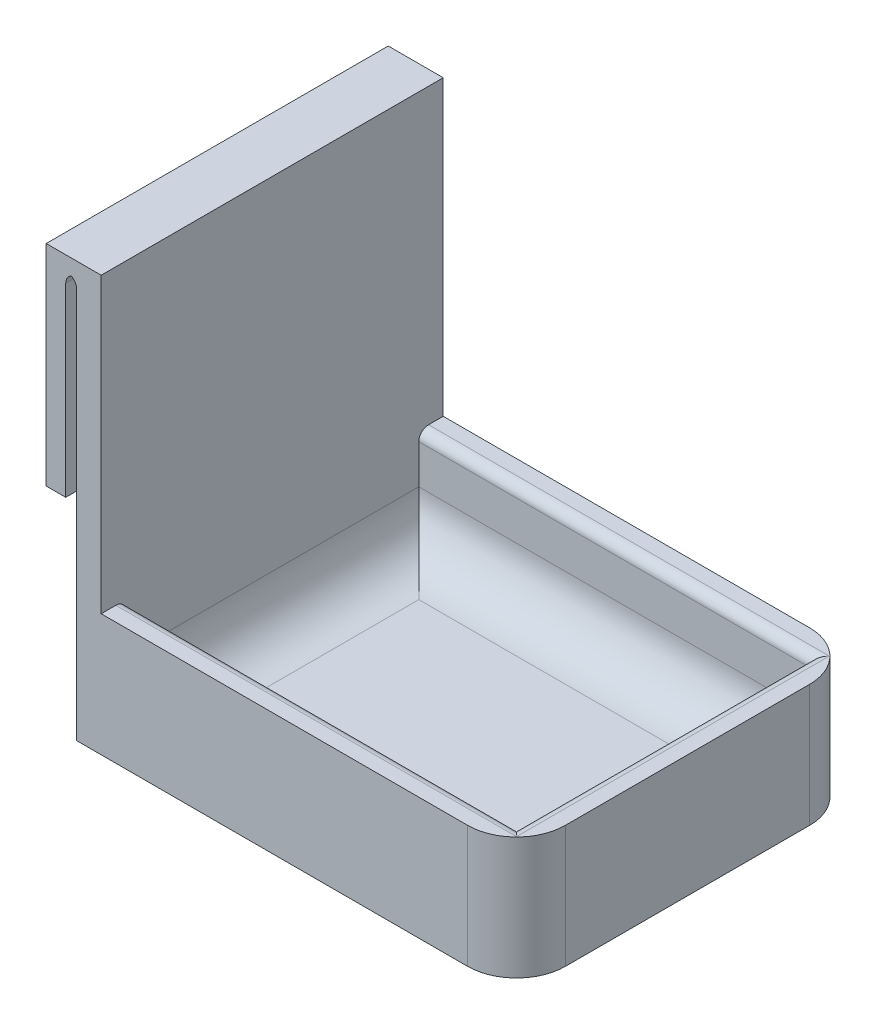
ISO-10303-21;
HEADER;
FILE_DESCRIPTION(('STEP AP214'),'2;1');
FILE_NAME('part.step','',(''),(''),'','','');
FILE_SCHEMA(('AUTOMOTIVE_DESIGN { 1 0 10303 214 1 1 1 1 }'));
ENDSEC;
DATA;
#1=APPLICATION_CONTEXT('core data for automotive mechanical design processes');
#2=APPLICATION_PROTOCOL_DEFINITION('international standard','automotive_design',2000,#1);
#3=PRODUCT_CONTEXT('',#1,'mechanical');
#4=PRODUCT('Part','Part','',(#3));
#5=PRODUCT_RELATED_PRODUCT_CATEGORY('part','',(#4));
#6=PRODUCT_DEFINITION_FORMATION('','',#4);
#7=PRODUCT_DEFINITION_CONTEXT('part definition',#1,'design');
#8=PRODUCT_DEFINITION('design','',#6,#7);
#9=PRODUCT_DEFINITION_SHAPE('','',#8);
#10=(LENGTH_UNIT() NAMED_UNIT(*) SI_UNIT(.MILLI.,.METRE.));
#11=(NAMED_UNIT(*) PLANE_ANGLE_UNIT() SI_UNIT($,.RADIAN.));
#12=(NAMED_UNIT(*) SI_UNIT($,.STERADIAN.) SOLID_ANGLE_UNIT());
#13=UNCERTAINTY_MEASURE_WITH_UNIT(LENGTH_MEASURE(1.E-05),#10,'distance_accuracy_value','');
#14=(GEOMETRIC_REPRESENTATION_CONTEXT(3) GLOBAL_UNCERTAINTY_ASSIGNED_CONTEXT((#13)) GLOBAL_UNIT_ASSIGNED_CONTEXT((#10,
#11,#12)) REPRESENTATION_CONTEXT('',''));
#15=CARTESIAN_POINT('',(0.,0.,0.));
#16=DIRECTION('',(0.,0.,1.));
#17=DIRECTION('',(1.,0.,0.));
#18=AXIS2_PLACEMENT_3D('',#15,#16,#17);
#19=CARTESIAN_POINT('',(0.,85.,0.));
#20=DIRECTION('',(0.,1.,0.));
#21=DIRECTION('',(0.,0.,1.));
#22=AXIS2_PLACEMENT_3D('',#19,#20,#21);
#23=PLANE('',#22);
#24=DIRECTION('',(1.,0.,0.));
#25=VECTOR('',#24,1.);
#26=CARTESIAN_POINT('',(0.,85.,70.));
#27=LINE('',#26,#25);
#28=CARTESIAN_POINT('',(-6.24999999999999,85.,70.));
#29=VERTEX_POINT('',#28);
#30=CARTESIAN_POINT('',(4.99999999999999,85.,70.));
#31=VERTEX_POINT('',#30);
#32=EDGE_CURVE('E244',#29,#31,#27,.T.);
#33=ORIENTED_EDGE('',*,*,#32,.T.);
#34=DIRECTION('',(0.,0.,1.));
#35=VECTOR('',#34,1.);
#36=CARTESIAN_POINT('',(5.,85.,5.));
#37=LINE('',#36,#35);
#38=CARTESIAN_POINT('',(4.99999999999996,85.,0.));
#39=VERTEX_POINT('',#38);
#40=EDGE_CURVE('E200',#39,#31,#37,.T.);
#41=ORIENTED_EDGE('',*,*,#40,.F.);
#42=DIRECTION('',(-1.,0.,0.));
#43=VECTOR('',#42,1.);
#44=CARTESIAN_POINT('',(0.,85.,0.));
#45=LINE('',#44,#43);
#46=CARTESIAN_POINT('',(-6.25,85.,0.));
#47=VERTEX_POINT('',#46);
#48=EDGE_CURVE('E246',#39,#47,#45,.T.);
#49=ORIENTED_EDGE('',*,*,#48,.T.);
#50=DIRECTION('',(0.,0.,-1.));
#51=VECTOR('',#50,1.);
#52=CARTESIAN_POINT('',(-6.25,85.,0.));
#53=LINE('',#52,#51);
#54=EDGE_CURVE('E232',#29,#47,#53,.T.);
#55=ORIENTED_EDGE('',*,*,#54,.F.);
#56=EDGE_LOOP('',(#33,#41,#49,#55));
#57=FACE_BOUND('',#56,.T.);
#58=ADVANCED_FACE('F39',(#57),#23,.T.);
#59=CARTESIAN_POINT('',(0.,5.,0.));
#60=DIRECTION('',(1.,0.,0.));
#61=DIRECTION('',(0.,0.,-1.));
#62=AXIS2_PLACEMENT_3D('',#59,#60,#61);
#63=PLANE('',#62);
#64=DIRECTION('',(0.,-1.,0.));
#65=VECTOR('',#64,1.);
#66=CARTESIAN_POINT('',(0.,5.,70.));
#67=LINE('',#66,#65);
#68=CARTESIAN_POINT('',(0.,80.,70.));
#69=VERTEX_POINT('',#68);
#70=CARTESIAN_POINT('',(0.,0.,70.));
#71=VERTEX_POINT('',#70);
#72=EDGE_CURVE('E261',#69,#71,#67,.T.);
#73=ORIENTED_EDGE('',*,*,#72,.F.);
#74=DIRECTION('',(0.,0.,1.));
#75=VECTOR('',#74,1.);
#76=CARTESIAN_POINT('',(0.,80.,0.));
#77=LINE('',#76,#75);
#78=CARTESIAN_POINT('',(0.,80.,0.));
#79=VERTEX_POINT('',#78);
#80=EDGE_CURVE('E284',#69,#79,#77,.F.);
#81=ORIENTED_EDGE('',*,*,#80,.T.);
#82=DIRECTION('',(0.,-1.,0.));
#83=VECTOR('',#82,1.);
#84=CARTESIAN_POINT('',(0.,5.,0.));
#85=LINE('',#84,#83);
#86=CARTESIAN_POINT('',(0.,0.,0.));
#87=VERTEX_POINT('',#86);
#88=EDGE_CURVE('E258',#79,#87,#85,.T.);
#89=ORIENTED_EDGE('',*,*,#88,.T.);
#90=DIRECTION('',(0.,0.,1.));
#91=VECTOR('',#90,1.);
#92=CARTESIAN_POINT('',(0.,0.,0.));
#93=LINE('',#92,#91);
#94=EDGE_CURVE('E248',#87,#71,#93,.T.);
#95=ORIENTED_EDGE('',*,*,#94,.T.);
#96=EDGE_LOOP('',(#73,#81,#89,#95));
#97=FACE_BOUND('',#96,.T.);
#98=ADVANCED_FACE('F358',(#97),#63,.F.);
#99=CARTESIAN_POINT('',(0.,5.,70.));
#100=DIRECTION('',(0.,0.,-1.));
#101=DIRECTION('',(-1.,0.,0.));
#102=AXIS2_PLACEMENT_3D('',#99,#100,#101);
#103=PLANE('',#102);
#104=DIRECTION('',(1.,0.,0.));
#105=VECTOR('',#104,1.);
#106=CARTESIAN_POINT('',(0.,0.,70.));
#107=LINE('',#106,#105);
#108=CARTESIAN_POINT('',(80.,0.,70.));
#109=VERTEX_POINT('',#108);
#110=EDGE_CURVE('E251',#71,#109,#107,.T.);
#111=ORIENTED_EDGE('',*,*,#110,.T.);
#112=DIRECTION('',(0.,-1.,0.));
#113=VECTOR('',#112,1.);
#114=CARTESIAN_POINT('',(80.,5.,70.));
#115=LINE('',#114,#113);
#116=CARTESIAN_POINT('',(80.,25.,70.));
#117=VERTEX_POINT('',#116);
#118=EDGE_CURVE('E62',#109,#117,#115,.F.);
#119=ORIENTED_EDGE('',*,*,#118,.T.);
#120=DIRECTION('',(1.,0.,0.));
#121=VECTOR('',#120,1.);
#122=CARTESIAN_POINT('',(4.99999999999999,25.,70.));
#123=LINE('',#122,#121);
#124=CARTESIAN_POINT('',(4.99999999999999,25.,70.));
#125=VERTEX_POINT('',#124);
#126=EDGE_CURVE('E188',#125,#117,#123,.T.);
#127=ORIENTED_EDGE('',*,*,#126,.F.);
#128=DIRECTION('',(0.,-1.,0.));
#129=VECTOR('',#128,1.);
#130=CARTESIAN_POINT('',(4.99999999999999,85.,70.));
#131=LINE('',#130,#129);
#132=EDGE_CURVE('E197',#31,#125,#131,.T.);
#133=ORIENTED_EDGE('',*,*,#132,.F.);
#134=ORIENTED_EDGE('',*,*,#32,.F.);
#135=DIRECTION('',(0.,1.,0.));
#136=VECTOR('',#135,1.);
#137=CARTESIAN_POINT('',(-6.24999999999999,85.,70.));
#138=LINE('',#137,#136);
#139=CARTESIAN_POINT('',(-6.24999999999999,42.,70.));
#140=VERTEX_POINT('',#139);
#141=EDGE_CURVE('E229',#140,#29,#138,.T.);
#142=ORIENTED_EDGE('',*,*,#141,.F.);
#143=DIRECTION('',(-1.,0.,0.));
#144=VECTOR('',#143,1.);
#145=CARTESIAN_POINT('',(-6.24999999999999,42.,70.));
#146=LINE('',#145,#144);
#147=CARTESIAN_POINT('',(-2.24999999999999,42.,70.));
#148=VERTEX_POINT('',#147);
#149=EDGE_CURVE('E218',#148,#140,#146,.T.);
#150=ORIENTED_EDGE('',*,*,#149,.F.);
#151=DIRECTION('',(0.,1.,0.));
#152=VECTOR('',#151,1.);
#153=CARTESIAN_POINT('',(-2.24999999999999,42.,70.));
#154=LINE('',#153,#152);
#155=CARTESIAN_POINT('',(-2.24999999999999,80.,70.));
#156=VERTEX_POINT('',#155);
#157=EDGE_CURVE('E221',#148,#156,#154,.T.);
#158=ORIENTED_EDGE('',*,*,#157,.T.);
#159=CARTESIAN_POINT('',(-0.249999999999992,80.,70.));
#160=DIRECTION('',(0.,0.,-1.));
#161=DIRECTION('',(-1.,0.,0.));
#162=AXIS2_PLACEMENT_3D('',#159,#160,#161);
#163=CIRCLE('',#162,2.);
#164=CARTESIAN_POINT('',(-1.12499999999999,81.7984368212423,70.));
#165=VERTEX_POINT('',#164);
#166=EDGE_CURVE('E305',#156,#165,#163,.T.);
#167=ORIENTED_EDGE('',*,*,#166,.T.);
#168=CARTESIAN_POINT('',(-1.99999999999999,80.,70.));
#169=DIRECTION('',(0.,0.,-1.));
#170=DIRECTION('',(-1.,0.,0.));
#171=AXIS2_PLACEMENT_3D('',#168,#169,#170);
#172=CIRCLE('',#171,2.);
#173=EDGE_CURVE('E301',#165,#69,#172,.T.);
#174=ORIENTED_EDGE('',*,*,#173,.T.);
#175=ORIENTED_EDGE('',*,*,#72,.T.);
#176=EDGE_LOOP('',(#111,#119,#127,#133,#134,#142,#150,#158,#167,#174,#175));
#177=FACE_BOUND('',#176,.T.);
#178=ADVANCED_FACE('F204',(#177),#103,.F.);
#179=CARTESIAN_POINT('',(90.,5.,0.));
#180=DIRECTION('',(-1.,0.,0.));
#181=DIRECTION('',(0.,0.,1.));
#182=AXIS2_PLACEMENT_3D('',#179,#180,#181);
#183=PLANE('',#182);
#184=DIRECTION('',(0.,0.,-1.));
#185=VECTOR('',#184,1.);
#186=CARTESIAN_POINT('',(90.,25.,70.));
#187=LINE('',#186,#185);
#188=CARTESIAN_POINT('',(90.,25.,60.));
#189=VERTEX_POINT('',#188);
#190=CARTESIAN_POINT('',(90.,25.,9.99999999999999));
#191=VERTEX_POINT('',#190);
#192=EDGE_CURVE('E202',#189,#191,#187,.T.);
#193=ORIENTED_EDGE('',*,*,#192,.F.);
#194=DIRECTION('',(0.,-1.,0.));
#195=VECTOR('',#194,1.);
#196=CARTESIAN_POINT('',(90.,5.,60.));
#197=LINE('',#196,#195);
#198=CARTESIAN_POINT('',(90.,0.,60.));
#199=VERTEX_POINT('',#198);
#200=EDGE_CURVE('E334',#189,#199,#197,.T.);
#201=ORIENTED_EDGE('',*,*,#200,.T.);
#202=DIRECTION('',(0.,0.,-1.));
#203=VECTOR('',#202,1.);
#204=CARTESIAN_POINT('',(90.,0.,0.));
#205=LINE('',#204,#203);
#206=CARTESIAN_POINT('',(90.,0.,10.));
#207=VERTEX_POINT('',#206);
#208=EDGE_CURVE('E253',#199,#207,#205,.T.);
#209=ORIENTED_EDGE('',*,*,#208,.T.);
#210=DIRECTION('',(0.,-1.,0.));
#211=VECTOR('',#210,1.);
#212=CARTESIAN_POINT('',(90.,5.,10.));
#213=LINE('',#212,#211);
#214=EDGE_CURVE('E327',#207,#191,#213,.F.);
#215=ORIENTED_EDGE('',*,*,#214,.T.);
#216=EDGE_LOOP('',(#193,#201,#209,#215));
#217=FACE_BOUND('',#216,.T.);
#218=ADVANCED_FACE('F346',(#217),#183,.F.);
#219=CARTESIAN_POINT('',(0.,5.,0.));
#220=DIRECTION('',(0.,0.,1.));
#221=DIRECTION('',(1.,0.,0.));
#222=AXIS2_PLACEMENT_3D('',#219,#220,#221);
#223=PLANE('',#222);
#224=DIRECTION('',(1.,0.,0.));
#225=VECTOR('',#224,1.);
#226=CARTESIAN_POINT('',(4.99999999999996,25.,0.));
#227=LINE('',#226,#225);
#228=CARTESIAN_POINT('',(4.99999999999996,25.,0.));
#229=VERTEX_POINT('',#228);
#230=CARTESIAN_POINT('',(80.,25.,0.));
#231=VERTEX_POINT('',#230);
#232=EDGE_CURVE('E205',#229,#231,#227,.T.);
#233=ORIENTED_EDGE('',*,*,#232,.T.);
#234=DIRECTION('',(0.,-1.,0.));
#235=VECTOR('',#234,1.);
#236=CARTESIAN_POINT('',(80.,5.,0.));
#237=LINE('',#236,#235);
#238=CARTESIAN_POINT('',(80.,0.,0.));
#239=VERTEX_POINT('',#238);
#240=EDGE_CURVE('E11',#231,#239,#237,.T.);
#241=ORIENTED_EDGE('',*,*,#240,.T.);
#242=DIRECTION('',(-1.,0.,0.));
#243=VECTOR('',#242,1.);
#244=CARTESIAN_POINT('',(0.,0.,0.));
#245=LINE('',#244,#243);
#246=EDGE_CURVE('E256',#239,#87,#245,.T.);
#247=ORIENTED_EDGE('',*,*,#246,.T.);
#248=ORIENTED_EDGE('',*,*,#88,.F.);
#249=CARTESIAN_POINT('',(-2.,80.,0.));
#250=DIRECTION('',(0.,0.,1.));
#251=DIRECTION('',(1.,0.,0.));
#252=AXIS2_PLACEMENT_3D('',#249,#250,#251);
#253=CIRCLE('',#252,2.);
#254=CARTESIAN_POINT('',(-1.12499999999999,81.7984368212423,0.));
#255=VERTEX_POINT('',#254);
#256=EDGE_CURVE('E303',#79,#255,#253,.T.);
#257=ORIENTED_EDGE('',*,*,#256,.T.);
#258=CARTESIAN_POINT('',(-0.249999999999983,80.,0.));
#259=DIRECTION('',(0.,0.,1.));
#260=DIRECTION('',(1.,0.,0.));
#261=AXIS2_PLACEMENT_3D('',#258,#259,#260);
#262=CIRCLE('',#261,2.);
#263=CARTESIAN_POINT('',(-2.24999999999998,80.,0.));
#264=VERTEX_POINT('',#263);
#265=EDGE_CURVE('E307',#255,#264,#262,.T.);
#266=ORIENTED_EDGE('',*,*,#265,.T.);
#267=DIRECTION('',(0.,1.,0.));
#268=VECTOR('',#267,1.);
#269=CARTESIAN_POINT('',(-2.24999999999998,42.,0.));
#270=LINE('',#269,#268);
#271=CARTESIAN_POINT('',(-2.24999999999998,42.,0.));
#272=VERTEX_POINT('',#271);
#273=EDGE_CURVE('E224',#272,#264,#270,.T.);
#274=ORIENTED_EDGE('',*,*,#273,.F.);
#275=DIRECTION('',(1.,0.,0.));
#276=VECTOR('',#275,1.);
#277=CARTESIAN_POINT('',(-6.24999999999999,42.,0.));
#278=LINE('',#277,#276);
#279=CARTESIAN_POINT('',(-6.24999999999999,42.,0.));
#280=VERTEX_POINT('',#279);
#281=EDGE_CURVE('E214',#280,#272,#278,.T.);
#282=ORIENTED_EDGE('',*,*,#281,.F.);
#283=DIRECTION('',(0.,-1.,0.));
#284=VECTOR('',#283,1.);
#285=CARTESIAN_POINT('',(-6.25,85.,0.));
#286=LINE('',#285,#284);
#287=EDGE_CURVE('E227',#47,#280,#286,.T.);
#288=ORIENTED_EDGE('',*,*,#287,.F.);
#289=ORIENTED_EDGE('',*,*,#48,.F.);
#290=DIRECTION('',(0.,1.,0.));
#291=VECTOR('',#290,1.);
#292=CARTESIAN_POINT('',(4.99999999999996,85.,0.));
#293=LINE('',#292,#291);
#294=EDGE_CURVE('E193',#229,#39,#293,.T.);
#295=ORIENTED_EDGE('',*,*,#294,.F.);
#296=EDGE_LOOP('',(#233,#241,#247,#248,#257,#266,#274,#282,#288,#289,#295));
#297=FACE_BOUND('',#296,.T.);
#298=ADVANCED_FACE('F365',(#297),#223,.F.);
#299=CARTESIAN_POINT('',(0.,0.,0.));
#300=DIRECTION('',(0.,1.,0.));
#301=DIRECTION('',(0.,0.,1.));
#302=AXIS2_PLACEMENT_3D('',#299,#300,#301);
#303=PLANE('',#302);
#304=ORIENTED_EDGE('',*,*,#208,.F.);
#305=CARTESIAN_POINT('',(80.,0.,60.));
#306=DIRECTION('',(0.,1.,0.));
#307=DIRECTION('',(0.,0.,1.));
#308=AXIS2_PLACEMENT_3D('',#305,#306,#307);
#309=CIRCLE('',#308,10.);
#310=EDGE_CURVE('E339',#199,#109,#309,.F.);
#311=ORIENTED_EDGE('',*,*,#310,.T.);
#312=ORIENTED_EDGE('',*,*,#110,.F.);
#313=ORIENTED_EDGE('',*,*,#94,.F.);
#314=ORIENTED_EDGE('',*,*,#246,.F.);
#315=CARTESIAN_POINT('',(80.,0.,10.));
#316=DIRECTION('',(0.,1.,0.));
#317=DIRECTION('',(0.,0.,1.));
#318=AXIS2_PLACEMENT_3D('',#315,#316,#317);
#319=CIRCLE('',#318,10.);
#320=EDGE_CURVE('E337',#239,#207,#319,.F.);
#321=ORIENTED_EDGE('',*,*,#320,.T.);
#322=EDGE_LOOP('',(#304,#311,#312,#313,#314,#321));
#323=FACE_BOUND('',#322,.T.);
#324=ADVANCED_FACE('F352',(#323),#303,.F.);
#325=CARTESIAN_POINT('',(5.,85.,5.));
#326=DIRECTION('',(1.,0.,0.));
#327=DIRECTION('',(0.,0.,-1.));
#328=AXIS2_PLACEMENT_3D('',#325,#326,#327);
#329=PLANE('',#328);
#330=DIRECTION('',(0.,0.,-1.));
#331=VECTOR('',#330,1.);
#332=CARTESIAN_POINT('',(4.99999999999999,25.,70.));
#333=LINE('',#332,#331);
#334=CARTESIAN_POINT('',(4.99999999999999,25.,67.));
#335=VERTEX_POINT('',#334);
#336=EDGE_CURVE('E185',#125,#335,#333,.T.);
#337=ORIENTED_EDGE('',*,*,#336,.T.);
#338=CARTESIAN_POINT('',(5.00000000000001,23.,67.));
#339=DIRECTION('',(1.,0.,0.));
#340=DIRECTION('',(0.,0.,-1.));
#341=AXIS2_PLACEMENT_3D('',#338,#339,#340);
#342=CIRCLE('',#341,2.);
#343=CARTESIAN_POINT('',(5.00000000000001,23.,65.));
#344=VERTEX_POINT('',#343);
#345=EDGE_CURVE('E323',#335,#344,#342,.F.);
#346=ORIENTED_EDGE('',*,*,#345,.T.);
#347=DIRECTION('',(0.,-1.,0.));
#348=VECTOR('',#347,1.);
#349=CARTESIAN_POINT('',(5.00000000000001,85.,65.));
#350=LINE('',#349,#348);
#351=CARTESIAN_POINT('',(5.00000000000001,15.,65.));
#352=VERTEX_POINT('',#351);
#353=EDGE_CURVE('E242',#344,#352,#350,.T.);
#354=ORIENTED_EDGE('',*,*,#353,.T.);
#355=DIRECTION('',(0.,0.,1.));
#356=VECTOR('',#355,1.);
#357=CARTESIAN_POINT('',(5.,15.,5.));
#358=LINE('',#357,#356);
#359=CARTESIAN_POINT('',(5.,15.,5.));
#360=VERTEX_POINT('',#359);
#361=EDGE_CURVE('E278',#352,#360,#358,.F.);
#362=ORIENTED_EDGE('',*,*,#361,.T.);
#363=DIRECTION('',(0.,-1.,0.));
#364=VECTOR('',#363,1.);
#365=CARTESIAN_POINT('',(5.,85.,5.));
#366=LINE('',#365,#364);
#367=CARTESIAN_POINT('',(5.,23.,5.));
#368=VERTEX_POINT('',#367);
#369=EDGE_CURVE('E236',#368,#360,#366,.T.);
#370=ORIENTED_EDGE('',*,*,#369,.F.);
#371=CARTESIAN_POINT('',(5.,23.,3.));
#372=DIRECTION('',(1.,0.,0.));
#373=DIRECTION('',(0.,0.,-1.));
#374=AXIS2_PLACEMENT_3D('',#371,#372,#373);
#375=CIRCLE('',#374,2.);
#376=CARTESIAN_POINT('',(4.99999999999996,25.,3.));
#377=VERTEX_POINT('',#376);
#378=EDGE_CURVE('E325',#368,#377,#375,.F.);
#379=ORIENTED_EDGE('',*,*,#378,.T.);
#380=EDGE_CURVE('E194',#377,#229,#333,.T.);
#381=ORIENTED_EDGE('',*,*,#380,.T.);
#382=ORIENTED_EDGE('',*,*,#294,.T.);
#383=ORIENTED_EDGE('',*,*,#40,.T.);
#384=ORIENTED_EDGE('',*,*,#132,.T.);
#385=EDGE_LOOP('',(#337,#346,#354,#362,#370,#379,#381,#382,#383,#384));
#386=FACE_BOUND('',#385,.T.);
#387=ADVANCED_FACE('F198',(#386),#329,.T.);
#388=CARTESIAN_POINT('',(5.00000000000001,85.,65.));
#389=DIRECTION('',(0.,0.,-1.));
#390=DIRECTION('',(-1.,0.,0.));
#391=AXIS2_PLACEMENT_3D('',#388,#389,#390);
#392=PLANE('',#391);
#393=ORIENTED_EDGE('',*,*,#353,.F.);
#394=DIRECTION('',(-1.,0.,0.));
#395=VECTOR('',#394,1.);
#396=CARTESIAN_POINT('',(85.,23.,65.));
#397=LINE('',#396,#395);
#398=CARTESIAN_POINT('',(85.,23.,65.));
#399=VERTEX_POINT('',#398);
#400=EDGE_CURVE('E317',#344,#399,#397,.F.);
#401=ORIENTED_EDGE('',*,*,#400,.T.);
#402=DIRECTION('',(0.,-1.,0.));
#403=VECTOR('',#402,1.);
#404=CARTESIAN_POINT('',(85.,85.,65.));
#405=LINE('',#404,#403);
#406=CARTESIAN_POINT('',(85.,15.,65.));
#407=VERTEX_POINT('',#406);
#408=EDGE_CURVE('E240',#399,#407,#405,.T.);
#409=ORIENTED_EDGE('',*,*,#408,.T.);
#410=DIRECTION('',(1.,0.,0.));
#411=VECTOR('',#410,1.);
#412=CARTESIAN_POINT('',(5.00000000000001,15.,65.));
#413=LINE('',#412,#411);
#414=EDGE_CURVE('E281',#407,#352,#413,.F.);
#415=ORIENTED_EDGE('',*,*,#414,.T.);
#416=EDGE_LOOP('',(#393,#401,#409,#415));
#417=FACE_BOUND('',#416,.T.);
#418=ADVANCED_FACE('F463',(#417),#392,.T.);
#419=CARTESIAN_POINT('',(85.,85.,5.));
#420=DIRECTION('',(-1.,0.,0.));
#421=DIRECTION('',(0.,0.,1.));
#422=AXIS2_PLACEMENT_3D('',#419,#420,#421);
#423=PLANE('',#422);
#424=ORIENTED_EDGE('',*,*,#408,.F.);
#425=DIRECTION('',(0.,0.,1.));
#426=VECTOR('',#425,1.);
#427=CARTESIAN_POINT('',(85.,23.,5.00000000000001));
#428=LINE('',#427,#426);
#429=CARTESIAN_POINT('',(85.,23.,5.));
#430=VERTEX_POINT('',#429);
#431=EDGE_CURVE('E319',#399,#430,#428,.F.);
#432=ORIENTED_EDGE('',*,*,#431,.T.);
#433=DIRECTION('',(0.,-1.,0.));
#434=VECTOR('',#433,1.);
#435=CARTESIAN_POINT('',(85.,85.,5.));
#436=LINE('',#435,#434);
#437=CARTESIAN_POINT('',(85.,15.,5.));
#438=VERTEX_POINT('',#437);
#439=EDGE_CURVE('E238',#430,#438,#436,.T.);
#440=ORIENTED_EDGE('',*,*,#439,.T.);
#441=DIRECTION('',(0.,0.,-1.));
#442=VECTOR('',#441,1.);
#443=CARTESIAN_POINT('',(85.,15.,65.));
#444=LINE('',#443,#442);
#445=EDGE_CURVE('E275',#438,#407,#444,.F.);
#446=ORIENTED_EDGE('',*,*,#445,.T.);
#447=EDGE_LOOP('',(#424,#432,#440,#446));
#448=FACE_BOUND('',#447,.T.);
#449=ADVANCED_FACE('F479',(#448),#423,.T.);
#450=CARTESIAN_POINT('',(5.,85.,5.));
#451=DIRECTION('',(0.,0.,1.));
#452=DIRECTION('',(1.,0.,0.));
#453=AXIS2_PLACEMENT_3D('',#450,#451,#452);
#454=PLANE('',#453);
#455=ORIENTED_EDGE('',*,*,#439,.F.);
#456=DIRECTION('',(1.,0.,0.));
#457=VECTOR('',#456,1.);
#458=CARTESIAN_POINT('',(4.99999999999996,23.,5.));
#459=LINE('',#458,#457);
#460=EDGE_CURVE('E321',#430,#368,#459,.F.);
#461=ORIENTED_EDGE('',*,*,#460,.T.);
#462=ORIENTED_EDGE('',*,*,#369,.T.);
#463=DIRECTION('',(-1.,0.,0.));
#464=VECTOR('',#463,1.);
#465=CARTESIAN_POINT('',(85.,15.,5.));
#466=LINE('',#465,#464);
#467=EDGE_CURVE('E272',#360,#438,#466,.F.);
#468=ORIENTED_EDGE('',*,*,#467,.T.);
#469=EDGE_LOOP('',(#455,#461,#462,#468));
#470=FACE_BOUND('',#469,.T.);
#471=ADVANCED_FACE('F412',(#470),#454,.T.);
#472=CARTESIAN_POINT('',(0.,5.,0.));
#473=DIRECTION('',(0.,1.,0.));
#474=DIRECTION('',(0.,0.,1.));
#475=AXIS2_PLACEMENT_3D('',#472,#473,#474);
#476=PLANE('',#475);
#477=DIRECTION('',(0.,0.,-1.));
#478=VECTOR('',#477,1.);
#479=CARTESIAN_POINT('',(75.,5.,5.));
#480=LINE('',#479,#478);
#481=CARTESIAN_POINT('',(75.,5.,55.));
#482=VERTEX_POINT('',#481);
#483=CARTESIAN_POINT('',(75.,5.,15.));
#484=VERTEX_POINT('',#483);
#485=EDGE_CURVE('E267',#482,#484,#480,.T.);
#486=ORIENTED_EDGE('',*,*,#485,.T.);
#487=DIRECTION('',(-1.,0.,0.));
#488=VECTOR('',#487,1.);
#489=CARTESIAN_POINT('',(5.,5.,15.));
#490=LINE('',#489,#488);
#491=CARTESIAN_POINT('',(15.,5.,15.));
#492=VERTEX_POINT('',#491);
#493=EDGE_CURVE('E269',#484,#492,#490,.T.);
#494=ORIENTED_EDGE('',*,*,#493,.T.);
#495=DIRECTION('',(0.,0.,1.));
#496=VECTOR('',#495,1.);
#497=CARTESIAN_POINT('',(15.,5.,65.));
#498=LINE('',#497,#496);
#499=CARTESIAN_POINT('',(15.,5.,55.));
#500=VERTEX_POINT('',#499);
#501=EDGE_CURVE('E265',#492,#500,#498,.T.);
#502=ORIENTED_EDGE('',*,*,#501,.T.);
#503=DIRECTION('',(1.,0.,0.));
#504=VECTOR('',#503,1.);
#505=CARTESIAN_POINT('',(85.,5.,55.));
#506=LINE('',#505,#504);
#507=EDGE_CURVE('E263',#500,#482,#506,.T.);
#508=ORIENTED_EDGE('',*,*,#507,.T.);
#509=EDGE_LOOP('',(#486,#494,#502,#508));
#510=FACE_BOUND('',#509,.T.);
#511=ADVANCED_FACE('F410',(#510),#476,.T.);
#512=CARTESIAN_POINT('',(-6.25,0.,0.));
#513=DIRECTION('',(-1.,0.,0.));
#514=DIRECTION('',(0.,0.,1.));
#515=AXIS2_PLACEMENT_3D('',#512,#513,#514);
#516=PLANE('',#515);
#517=ORIENTED_EDGE('',*,*,#287,.T.);
#518=DIRECTION('',(0.,0.,-1.));
#519=VECTOR('',#518,1.);
#520=CARTESIAN_POINT('',(-6.24999999999999,42.,70.));
#521=LINE('',#520,#519);
#522=EDGE_CURVE('E207',#140,#280,#521,.T.);
#523=ORIENTED_EDGE('',*,*,#522,.F.);
#524=ORIENTED_EDGE('',*,*,#141,.T.);
#525=ORIENTED_EDGE('',*,*,#54,.T.);
#526=EDGE_LOOP('',(#517,#523,#524,#525));
#527=FACE_BOUND('',#526,.T.);
#528=ADVANCED_FACE('F380',(#527),#516,.T.);
#529=CARTESIAN_POINT('',(-2.24999999999999,42.,70.));
#530=DIRECTION('',(-1.,0.,0.));
#531=DIRECTION('',(0.,0.,1.));
#532=AXIS2_PLACEMENT_3D('',#529,#530,#531);
#533=PLANE('',#532);
#534=ORIENTED_EDGE('',*,*,#273,.T.);
#535=DIRECTION('',(0.,0.,1.));
#536=VECTOR('',#535,1.);
#537=CARTESIAN_POINT('',(-2.24999999999999,80.,70.));
#538=LINE('',#537,#536);
#539=EDGE_CURVE('E299',#264,#156,#538,.T.);
#540=ORIENTED_EDGE('',*,*,#539,.T.);
#541=ORIENTED_EDGE('',*,*,#157,.F.);
#542=DIRECTION('',(0.,0.,1.));
#543=VECTOR('',#542,1.);
#544=CARTESIAN_POINT('',(-2.24999999999999,42.,70.));
#545=LINE('',#544,#543);
#546=EDGE_CURVE('E216',#272,#148,#545,.T.);
#547=ORIENTED_EDGE('',*,*,#546,.F.);
#548=EDGE_LOOP('',(#534,#540,#541,#547));
#549=FACE_BOUND('',#548,.T.);
#550=ADVANCED_FACE('F373',(#549),#533,.F.);
#551=CARTESIAN_POINT('',(0.,42.,0.));
#552=DIRECTION('',(0.,-1.,0.));
#553=DIRECTION('',(0.,0.,-1.));
#554=AXIS2_PLACEMENT_3D('',#551,#552,#553);
#555=PLANE('',#554);
#556=ORIENTED_EDGE('',*,*,#522,.T.);
#557=ORIENTED_EDGE('',*,*,#281,.T.);
#558=ORIENTED_EDGE('',*,*,#546,.T.);
#559=ORIENTED_EDGE('',*,*,#149,.T.);
#560=EDGE_LOOP('',(#556,#557,#558,#559));
#561=FACE_BOUND('',#560,.T.);
#562=ADVANCED_FACE('F378',(#561),#555,.T.);
#563=CARTESIAN_POINT('',(4.99999999999999,25.,70.));
#564=DIRECTION('',(0.,-1.,0.));
#565=DIRECTION('',(0.,0.,-1.));
#566=AXIS2_PLACEMENT_3D('',#563,#564,#565);
#567=PLANE('',#566);
#568=ORIENTED_EDGE('',*,*,#126,.T.);
#569=CARTESIAN_POINT('',(80.,25.,60.));
#570=DIRECTION('',(0.,-1.,0.));
#571=DIRECTION('',(0.,0.,-1.));
#572=AXIS2_PLACEMENT_3D('',#569,#570,#571);
#573=CIRCLE('',#572,10.);
#574=EDGE_CURVE('E47',#117,#189,#573,.F.);
#575=ORIENTED_EDGE('',*,*,#574,.T.);
#576=ORIENTED_EDGE('',*,*,#192,.T.);
#577=CARTESIAN_POINT('',(80.,25.,10.));
#578=DIRECTION('',(0.,-1.,0.));
#579=DIRECTION('',(0.,0.,-1.));
#580=AXIS2_PLACEMENT_3D('',#577,#578,#579);
#581=CIRCLE('',#580,10.);
#582=EDGE_CURVE('E54',#191,#231,#581,.F.);
#583=ORIENTED_EDGE('',*,*,#582,.T.);
#584=ORIENTED_EDGE('',*,*,#232,.F.);
#585=ORIENTED_EDGE('',*,*,#380,.F.);
#586=DIRECTION('',(1.,0.,0.));
#587=VECTOR('',#586,1.);
#588=CARTESIAN_POINT('',(85.,25.,3.));
#589=LINE('',#588,#587);
#590=CARTESIAN_POINT('',(87.,25.,3.));
#591=VERTEX_POINT('',#590);
#592=EDGE_CURVE('E309',#377,#591,#589,.T.);
#593=ORIENTED_EDGE('',*,*,#592,.T.);
#594=DIRECTION('',(0.,0.,1.));
#595=VECTOR('',#594,1.);
#596=CARTESIAN_POINT('',(87.,25.,65.));
#597=LINE('',#596,#595);
#598=CARTESIAN_POINT('',(87.,25.,67.));
#599=VERTEX_POINT('',#598);
#600=EDGE_CURVE('E314',#591,#599,#597,.T.);
#601=ORIENTED_EDGE('',*,*,#600,.T.);
#602=DIRECTION('',(-1.,0.,0.));
#603=VECTOR('',#602,1.);
#604=CARTESIAN_POINT('',(4.99999999999999,25.,67.));
#605=LINE('',#604,#603);
#606=EDGE_CURVE('E191',#599,#335,#605,.T.);
#607=ORIENTED_EDGE('',*,*,#606,.T.);
#608=ORIENTED_EDGE('',*,*,#336,.F.);
#609=EDGE_LOOP('',(#568,#575,#576,#583,#584,#585,#593,#601,#607,#608));
#610=FACE_BOUND('',#609,.T.);
#611=ADVANCED_FACE('F187',(#610),#567,.F.);
#612=CARTESIAN_POINT('',(0.,15.,55.));
#613=DIRECTION('',(-1.,0.,0.));
#614=DIRECTION('',(0.,0.,1.));
#615=AXIS2_PLACEMENT_3D('',#612,#613,#614);
#616=CYLINDRICAL_SURFACE('',#615,10.);
#617=CARTESIAN_POINT('',(15.,15.,55.));
#618=DIRECTION('',(-0.707106781186548,0.,-0.707106781186547));
#619=DIRECTION('',(0.707106781186547,0.,-0.707106781186548));
#620=AXIS2_PLACEMENT_3D('',#617,#618,#619);
#621=ELLIPSE('',#620,14.1421356237309,10.);
#622=EDGE_CURVE('E291',#352,#500,#621,.F.);
#623=ORIENTED_EDGE('',*,*,#622,.F.);
#624=ORIENTED_EDGE('',*,*,#414,.F.);
#625=CARTESIAN_POINT('',(75.,15.,55.));
#626=DIRECTION('',(-0.707106781186547,0.,0.707106781186548));
#627=DIRECTION('',(0.707106781186548,0.,0.707106781186547));
#628=AXIS2_PLACEMENT_3D('',#625,#626,#627);
#629=ELLIPSE('',#628,14.142135623731,10.);
#630=EDGE_CURVE('E294',#482,#407,#629,.T.);
#631=ORIENTED_EDGE('',*,*,#630,.F.);
#632=ORIENTED_EDGE('',*,*,#507,.F.);
#633=EDGE_LOOP('',(#623,#624,#631,#632));
#634=FACE_BOUND('',#633,.T.);
#635=ADVANCED_FACE('F433',(#634),#616,.F.);
#636=CARTESIAN_POINT('',(75.,15.,0.));
#637=DIRECTION('',(0.,0.,1.));
#638=DIRECTION('',(1.,0.,0.));
#639=AXIS2_PLACEMENT_3D('',#636,#637,#638);
#640=CYLINDRICAL_SURFACE('',#639,10.);
#641=ORIENTED_EDGE('',*,*,#630,.T.);
#642=ORIENTED_EDGE('',*,*,#445,.F.);
#643=CARTESIAN_POINT('',(75.,15.,15.));
#644=DIRECTION('',(0.707106781186548,0.,0.707106781186547));
#645=DIRECTION('',(0.707106781186547,0.,-0.707106781186548));
#646=AXIS2_PLACEMENT_3D('',#643,#644,#645);
#647=ELLIPSE('',#646,14.1421356237309,10.);
#648=EDGE_CURVE('E287',#484,#438,#647,.T.);
#649=ORIENTED_EDGE('',*,*,#648,.F.);
#650=ORIENTED_EDGE('',*,*,#485,.F.);
#651=EDGE_LOOP('',(#641,#642,#649,#650));
#652=FACE_BOUND('',#651,.T.);
#653=ADVANCED_FACE('F429',(#652),#640,.F.);
#654=CARTESIAN_POINT('',(15.,15.,0.));
#655=DIRECTION('',(0.,0.,-1.));
#656=DIRECTION('',(-1.,0.,0.));
#657=AXIS2_PLACEMENT_3D('',#654,#655,#656);
#658=CYLINDRICAL_SURFACE('',#657,10.);
#659=ORIENTED_EDGE('',*,*,#622,.T.);
#660=ORIENTED_EDGE('',*,*,#501,.F.);
#661=CARTESIAN_POINT('',(15.,15.,15.));
#662=DIRECTION('',(0.707106781186547,0.,-0.707106781186548));
#663=DIRECTION('',(0.707106781186548,0.,0.707106781186547));
#664=AXIS2_PLACEMENT_3D('',#661,#662,#663);
#665=ELLIPSE('',#664,14.142135623731,10.);
#666=EDGE_CURVE('E285',#360,#492,#665,.F.);
#667=ORIENTED_EDGE('',*,*,#666,.F.);
#668=ORIENTED_EDGE('',*,*,#361,.F.);
#669=EDGE_LOOP('',(#659,#660,#667,#668));
#670=FACE_BOUND('',#669,.T.);
#671=ADVANCED_FACE('F425',(#670),#658,.F.);
#672=CARTESIAN_POINT('',(0.,15.,15.));
#673=DIRECTION('',(1.,0.,0.));
#674=DIRECTION('',(0.,0.,-1.));
#675=AXIS2_PLACEMENT_3D('',#672,#673,#674);
#676=CYLINDRICAL_SURFACE('',#675,10.);
#677=ORIENTED_EDGE('',*,*,#648,.T.);
#678=ORIENTED_EDGE('',*,*,#467,.F.);
#679=ORIENTED_EDGE('',*,*,#666,.T.);
#680=ORIENTED_EDGE('',*,*,#493,.F.);
#681=EDGE_LOOP('',(#677,#678,#679,#680));
#682=FACE_BOUND('',#681,.T.);
#683=ADVANCED_FACE('F422',(#682),#676,.F.);
#684=CARTESIAN_POINT('',(-0.249999999999992,80.,70.));
#685=DIRECTION('',(0.,0.,-1.));
#686=DIRECTION('',(-1.,0.,0.));
#687=AXIS2_PLACEMENT_3D('',#684,#685,#686);
#688=CYLINDRICAL_SURFACE('',#687,2.);
#689=ORIENTED_EDGE('',*,*,#539,.F.);
#690=ORIENTED_EDGE('',*,*,#265,.F.);
#691=DIRECTION('',(0.,0.,-1.));
#692=VECTOR('',#691,1.);
#693=CARTESIAN_POINT('',(-1.12499999999999,81.7984368212423,35.));
#694=LINE('',#693,#692);
#695=EDGE_CURVE('E288',#165,#255,#694,.T.);
#696=ORIENTED_EDGE('',*,*,#695,.F.);
#697=ORIENTED_EDGE('',*,*,#166,.F.);
#698=EDGE_LOOP('',(#689,#690,#696,#697));
#699=FACE_BOUND('',#698,.T.);
#700=ADVANCED_FACE('F369',(#699),#688,.F.);
#701=CARTESIAN_POINT('',(-2.,80.,0.));
#702=DIRECTION('',(0.,0.,-1.));
#703=DIRECTION('',(-1.,0.,0.));
#704=AXIS2_PLACEMENT_3D('',#701,#702,#703);
#705=CYLINDRICAL_SURFACE('',#704,2.);
#706=ORIENTED_EDGE('',*,*,#256,.F.);
#707=ORIENTED_EDGE('',*,*,#80,.F.);
#708=ORIENTED_EDGE('',*,*,#173,.F.);
#709=ORIENTED_EDGE('',*,*,#695,.T.);
#710=EDGE_LOOP('',(#706,#707,#708,#709));
#711=FACE_BOUND('',#710,.T.);
#712=ADVANCED_FACE('F361',(#711),#705,.F.);
#713=CARTESIAN_POINT('',(4.99999999999999,23.,3.));
#714=DIRECTION('',(-1.,0.,0.));
#715=DIRECTION('',(0.,0.,1.));
#716=AXIS2_PLACEMENT_3D('',#713,#714,#715);
#717=CYLINDRICAL_SURFACE('',#716,2.);
#718=ORIENTED_EDGE('',*,*,#378,.F.);
#719=ORIENTED_EDGE('',*,*,#460,.F.);
#720=CARTESIAN_POINT('',(87.,23.,3.));
#721=DIRECTION('',(-0.707106781186548,0.,-0.707106781186547));
#722=DIRECTION('',(0.707106781186547,0.,-0.707106781186548));
#723=AXIS2_PLACEMENT_3D('',#720,#721,#722);
#724=ELLIPSE('',#723,2.82842712474619,2.);
#725=EDGE_CURVE('E312',#591,#430,#724,.F.);
#726=ORIENTED_EDGE('',*,*,#725,.F.);
#727=ORIENTED_EDGE('',*,*,#592,.F.);
#728=EDGE_LOOP('',(#718,#719,#726,#727));
#729=FACE_BOUND('',#728,.T.);
#730=ADVANCED_FACE('F440',(#729),#717,.T.);
#731=CARTESIAN_POINT('',(87.,23.,70.));
#732=DIRECTION('',(0.,0.,-1.));
#733=DIRECTION('',(-1.,0.,0.));
#734=AXIS2_PLACEMENT_3D('',#731,#732,#733);
#735=CYLINDRICAL_SURFACE('',#734,2.);
#736=ORIENTED_EDGE('',*,*,#725,.T.);
#737=ORIENTED_EDGE('',*,*,#431,.F.);
#738=CARTESIAN_POINT('',(87.,23.,67.));
#739=DIRECTION('',(0.707106781186547,0.,-0.707106781186548));
#740=DIRECTION('',(0.707106781186548,0.,0.707106781186547));
#741=AXIS2_PLACEMENT_3D('',#738,#739,#740);
#742=ELLIPSE('',#741,2.82842712474619,2.);
#743=EDGE_CURVE('E328',#599,#399,#742,.F.);
#744=ORIENTED_EDGE('',*,*,#743,.F.);
#745=ORIENTED_EDGE('',*,*,#600,.F.);
#746=EDGE_LOOP('',(#736,#737,#744,#745));
#747=FACE_BOUND('',#746,.T.);
#748=ADVANCED_FACE('F445',(#747),#735,.T.);
#749=CARTESIAN_POINT('',(4.99999999999999,23.,67.));
#750=DIRECTION('',(1.,0.,0.));
#751=DIRECTION('',(0.,0.,-1.));
#752=AXIS2_PLACEMENT_3D('',#749,#750,#751);
#753=CYLINDRICAL_SURFACE('',#752,2.);
#754=ORIENTED_EDGE('',*,*,#743,.T.);
#755=ORIENTED_EDGE('',*,*,#400,.F.);
#756=ORIENTED_EDGE('',*,*,#345,.F.);
#757=ORIENTED_EDGE('',*,*,#606,.F.);
#758=EDGE_LOOP('',(#754,#755,#756,#757));
#759=FACE_BOUND('',#758,.T.);
#760=ADVANCED_FACE('F398',(#759),#753,.T.);
#761=CARTESIAN_POINT('',(80.,5.,60.));
#762=DIRECTION('',(0.,-1.,0.));
#763=DIRECTION('',(0.,0.,-1.));
#764=AXIS2_PLACEMENT_3D('',#761,#762,#763);
#765=CYLINDRICAL_SURFACE('',#764,10.);
#766=ORIENTED_EDGE('',*,*,#574,.F.);
#767=ORIENTED_EDGE('',*,*,#118,.F.);
#768=ORIENTED_EDGE('',*,*,#310,.F.);
#769=ORIENTED_EDGE('',*,*,#200,.F.);
#770=EDGE_LOOP('',(#766,#767,#768,#769));
#771=FACE_BOUND('',#770,.T.);
#772=ADVANCED_FACE('F349',(#771),#765,.T.);
#773=CARTESIAN_POINT('',(80.,5.,10.));
#774=DIRECTION('',(0.,-1.,0.));
#775=DIRECTION('',(0.,0.,-1.));
#776=AXIS2_PLACEMENT_3D('',#773,#774,#775);
#777=CYLINDRICAL_SURFACE('',#776,10.);
#778=ORIENTED_EDGE('',*,*,#582,.F.);
#779=ORIENTED_EDGE('',*,*,#214,.F.);
#780=ORIENTED_EDGE('',*,*,#320,.F.);
#781=ORIENTED_EDGE('',*,*,#240,.F.);
#782=EDGE_LOOP('',(#778,#779,#780,#781));
#783=FACE_BOUND('',#782,.T.);
#784=ADVANCED_FACE('F41',(#783),#777,.T.);
#785=CLOSED_SHELL('',(#58,#98,#178,#218,#298,#324,#387,#418,#449,#471,#511,#528,#550,#562,#611,
#635,#653,#671,#683,#700,#712,#730,#748,#760,#772,#784));
#786=MANIFOLD_SOLID_BREP('B2',#785);
#787=ADVANCED_BREP_SHAPE_REPRESENTATION('',(#18,#786),#14);
#788=SHAPE_DEFINITION_REPRESENTATION(#9,#787);
ENDSEC;
END-ISO-10303-21;
